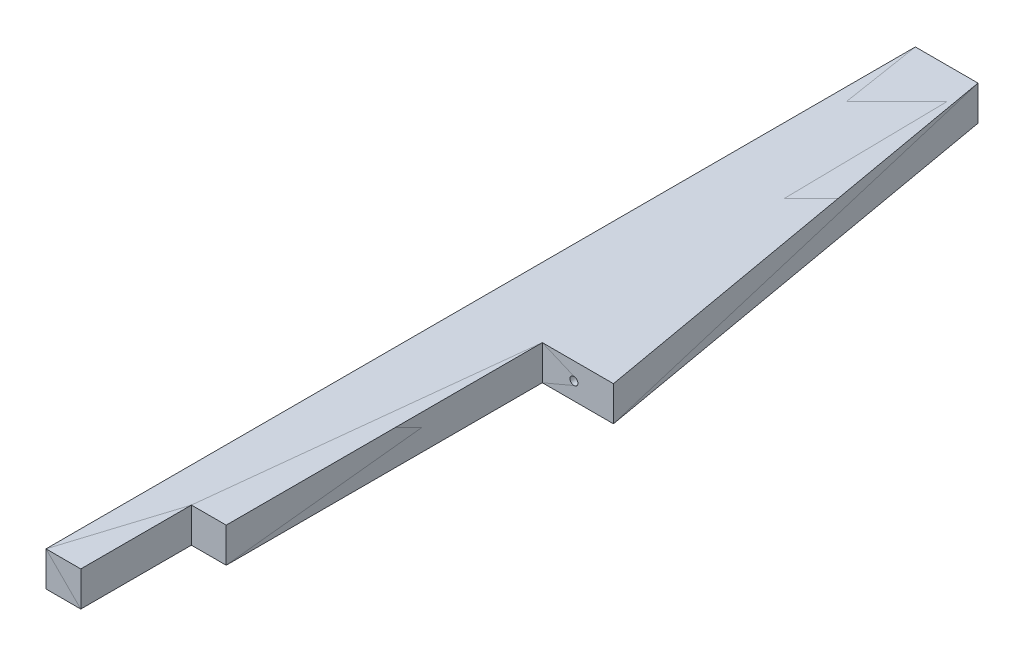
ISO-10303-21;
HEADER;
FILE_DESCRIPTION(('STEP AP214'),'2;1');
FILE_NAME('part.step','',(''),(''),'','','');
FILE_SCHEMA(('AUTOMOTIVE_DESIGN { 1 0 10303 214 1 1 1 1 }'));
ENDSEC;
DATA;
#1=APPLICATION_CONTEXT('core data for automotive mechanical design processes');
#2=APPLICATION_PROTOCOL_DEFINITION('international standard','automotive_design',2000,#1);
#3=PRODUCT_CONTEXT('',#1,'mechanical');
#4=PRODUCT('Part','Part','',(#3));
#5=PRODUCT_RELATED_PRODUCT_CATEGORY('part','',(#4));
#6=PRODUCT_DEFINITION_FORMATION('','',#4);
#7=PRODUCT_DEFINITION_CONTEXT('part definition',#1,'design');
#8=PRODUCT_DEFINITION('design','',#6,#7);
#9=PRODUCT_DEFINITION_SHAPE('','',#8);
#10=(LENGTH_UNIT() NAMED_UNIT(*) SI_UNIT(.MILLI.,.METRE.));
#11=(NAMED_UNIT(*) PLANE_ANGLE_UNIT() SI_UNIT($,.RADIAN.));
#12=(NAMED_UNIT(*) SI_UNIT($,.STERADIAN.) SOLID_ANGLE_UNIT());
#13=UNCERTAINTY_MEASURE_WITH_UNIT(LENGTH_MEASURE(1.E-05),#10,'distance_accuracy_value','');
#14=(GEOMETRIC_REPRESENTATION_CONTEXT(3) GLOBAL_UNCERTAINTY_ASSIGNED_CONTEXT((#13)) GLOBAL_UNIT_ASSIGNED_CONTEXT((#10,
#11,#12)) REPRESENTATION_CONTEXT('',''));
#15=CARTESIAN_POINT('',(0.,0.,0.));
#16=DIRECTION('',(0.,0.,1.));
#17=DIRECTION('',(1.,0.,0.));
#18=AXIS2_PLACEMENT_3D('',#15,#16,#17);
#19=CARTESIAN_POINT('',(0.,-0.01,-550.01));
#20=DIRECTION('',(-1.,0.,0.));
#21=DIRECTION('',(0.,0.,1.));
#22=AXIS2_PLACEMENT_3D('',#19,#20,#21);
#23=PLANE('',#22);
#24=DIRECTION('',(0.,0.,1.));
#25=VECTOR('',#24,1.);
#26=CARTESIAN_POINT('',(0.,22.,-275.));
#27=LINE('',#26,#25);
#28=CARTESIAN_POINT('',(0.,22.,-550.));
#29=VERTEX_POINT('',#28);
#30=CARTESIAN_POINT('',(0.,22.,0.));
#31=VERTEX_POINT('',#30);
#32=EDGE_CURVE('P0_E92',#29,#31,#27,.T.);
#33=ORIENTED_EDGE('',*,*,#32,.F.);
#34=DIRECTION('',(0.,1.,0.));
#35=VECTOR('',#34,1.);
#36=CARTESIAN_POINT('',(0.,11.,-550.));
#37=LINE('',#36,#35);
#38=CARTESIAN_POINT('',(0.,0.,-550.));
#39=VERTEX_POINT('',#38);
#40=EDGE_CURVE('P0_E89',#39,#29,#37,.T.);
#41=ORIENTED_EDGE('',*,*,#40,.F.);
#42=DIRECTION('',(0.,0.,-1.));
#43=VECTOR('',#42,1.);
#44=CARTESIAN_POINT('',(0.,0.,-275.));
#45=LINE('',#44,#43);
#46=CARTESIAN_POINT('',(0.,0.,0.));
#47=VERTEX_POINT('',#46);
#48=EDGE_CURVE('P0_E86',#47,#39,#45,.T.);
#49=ORIENTED_EDGE('',*,*,#48,.F.);
#50=DIRECTION('',(0.,-1.,0.));
#51=VECTOR('',#50,1.);
#52=CARTESIAN_POINT('',(0.,11.,0.));
#53=LINE('',#52,#51);
#54=EDGE_CURVE('P0_E115',#31,#47,#53,.T.);
#55=ORIENTED_EDGE('',*,*,#54,.F.);
#56=EDGE_LOOP('',(#33,#41,#49,#55));
#57=FACE_BOUND('',#56,.T.);
#58=ADVANCED_FACE('P0_F17',(#57),#23,.T.);
#59=CARTESIAN_POINT('',(-0.01,-0.01,0.));
#60=DIRECTION('',(0.,0.,1.));
#61=DIRECTION('',(1.,0.,0.));
#62=AXIS2_PLACEMENT_3D('',#59,#60,#61);
#63=PLANE('',#62);
#64=DIRECTION('',(1.,0.,0.));
#65=VECTOR('',#64,1.);
#66=CARTESIAN_POINT('',(44.5,22.,0.));
#67=LINE('',#66,#65);
#68=CARTESIAN_POINT('',(22.,22.,0.));
#69=VERTEX_POINT('',#68);
#70=EDGE_CURVE('P0_E153',#31,#69,#67,.T.);
#71=ORIENTED_EDGE('',*,*,#70,.F.);
#72=ORIENTED_EDGE('',*,*,#54,.T.);
#73=DIRECTION('',(-1.,0.,0.));
#74=VECTOR('',#73,1.);
#75=CARTESIAN_POINT('',(44.5,0.,0.));
#76=LINE('',#75,#74);
#77=CARTESIAN_POINT('',(22.,0.,0.));
#78=VERTEX_POINT('',#77);
#79=EDGE_CURVE('P0_E109',#78,#47,#76,.T.);
#80=ORIENTED_EDGE('',*,*,#79,.F.);
#81=DIRECTION('',(0.,-1.,0.));
#82=VECTOR('',#81,1.);
#83=CARTESIAN_POINT('',(22.,11.,0.));
#84=LINE('',#83,#82);
#85=EDGE_CURVE('P0_E97',#69,#78,#84,.T.);
#86=ORIENTED_EDGE('',*,*,#85,.F.);
#87=EDGE_LOOP('',(#71,#72,#80,#86));
#88=FACE_BOUND('',#87,.T.);
#89=ADVANCED_FACE('P0_F172',(#88),#63,.T.);
#90=CARTESIAN_POINT('',(22.,-0.01,0.01));
#91=DIRECTION('',(1.,0.,0.));
#92=DIRECTION('',(0.,0.,-1.));
#93=AXIS2_PLACEMENT_3D('',#90,#91,#92);
#94=PLANE('',#93);
#95=DIRECTION('',(0.,0.,-1.));
#96=VECTOR('',#95,1.);
#97=CARTESIAN_POINT('',(22.,22.,-275.));
#98=LINE('',#97,#96);
#99=CARTESIAN_POINT('',(22.,22.,-70.));
#100=VERTEX_POINT('',#99);
#101=EDGE_CURVE('P0_E150',#69,#100,#98,.T.);
#102=ORIENTED_EDGE('',*,*,#101,.F.);
#103=ORIENTED_EDGE('',*,*,#85,.T.);
#104=DIRECTION('',(0.,0.,1.));
#105=VECTOR('',#104,1.);
#106=CARTESIAN_POINT('',(22.,0.,-275.));
#107=LINE('',#106,#105);
#108=CARTESIAN_POINT('',(22.,0.,-70.));
#109=VERTEX_POINT('',#108);
#110=EDGE_CURVE('P0_E159',#109,#78,#107,.T.);
#111=ORIENTED_EDGE('',*,*,#110,.F.);
#112=DIRECTION('',(0.,-1.,0.));
#113=VECTOR('',#112,1.);
#114=CARTESIAN_POINT('',(22.,11.,-70.));
#115=LINE('',#114,#113);
#116=EDGE_CURVE('P0_E96',#100,#109,#115,.T.);
#117=ORIENTED_EDGE('',*,*,#116,.F.);
#118=EDGE_LOOP('',(#102,#103,#111,#117));
#119=FACE_BOUND('',#118,.T.);
#120=ADVANCED_FACE('P0_F169',(#119),#94,.T.);
#121=CARTESIAN_POINT('',(39.6384454016298,-0.01,-550.));
#122=DIRECTION('',(0.,0.,-1.));
#123=DIRECTION('',(-1.,0.,0.));
#124=AXIS2_PLACEMENT_3D('',#121,#122,#123);
#125=PLANE('',#124);
#126=DIRECTION('',(-1.,0.,0.));
#127=VECTOR('',#126,1.);
#128=CARTESIAN_POINT('',(44.5,22.,-550.));
#129=LINE('',#128,#127);
#130=CARTESIAN_POINT('',(39.6284454016298,22.,-550.));
#131=VERTEX_POINT('',#130);
#132=EDGE_CURVE('P0_E126',#131,#29,#129,.T.);
#133=ORIENTED_EDGE('',*,*,#132,.F.);
#134=DIRECTION('',(0.,1.,0.));
#135=VECTOR('',#134,1.);
#136=CARTESIAN_POINT('',(39.6284454016299,11.,-550.));
#137=LINE('',#136,#135);
#138=CARTESIAN_POINT('',(39.6284454016298,0.,-550.));
#139=VERTEX_POINT('',#138);
#140=EDGE_CURVE('P0_E102',#139,#131,#137,.T.);
#141=ORIENTED_EDGE('',*,*,#140,.F.);
#142=DIRECTION('',(1.,0.,0.));
#143=VECTOR('',#142,1.);
#144=CARTESIAN_POINT('',(44.5,0.,-550.));
#145=LINE('',#144,#143);
#146=EDGE_CURVE('P0_E100',#39,#139,#145,.T.);
#147=ORIENTED_EDGE('',*,*,#146,.F.);
#148=ORIENTED_EDGE('',*,*,#40,.T.);
#149=EDGE_LOOP('',(#133,#141,#147,#148));
#150=FACE_BOUND('',#149,.T.);
#151=ADVANCED_FACE('P0_F101',(#150),#125,.T.);
#152=CARTESIAN_POINT('',(21.99,-0.01,-70.));
#153=DIRECTION('',(0.,0.,1.));
#154=DIRECTION('',(1.,0.,0.));
#155=AXIS2_PLACEMENT_3D('',#152,#153,#154);
#156=PLANE('',#155);
#157=DIRECTION('',(1.,0.,0.));
#158=VECTOR('',#157,1.);
#159=CARTESIAN_POINT('',(44.5,22.,-70.));
#160=LINE('',#159,#158);
#161=CARTESIAN_POINT('',(44.,22.,-70.));
#162=VERTEX_POINT('',#161);
#163=EDGE_CURVE('P0_E148',#100,#162,#160,.T.);
#164=ORIENTED_EDGE('',*,*,#163,.F.);
#165=ORIENTED_EDGE('',*,*,#116,.T.);
#166=DIRECTION('',(-1.,0.,0.));
#167=VECTOR('',#166,1.);
#168=CARTESIAN_POINT('',(44.5,0.,-70.));
#169=LINE('',#168,#167);
#170=CARTESIAN_POINT('',(44.,0.,-70.));
#171=VERTEX_POINT('',#170);
#172=EDGE_CURVE('P0_E103',#171,#109,#169,.T.);
#173=ORIENTED_EDGE('',*,*,#172,.F.);
#174=DIRECTION('',(0.,-1.,0.));
#175=VECTOR('',#174,1.);
#176=CARTESIAN_POINT('',(44.,11.,-70.));
#177=LINE('',#176,#175);
#178=EDGE_CURVE('P0_E140',#162,#171,#177,.T.);
#179=ORIENTED_EDGE('',*,*,#178,.F.);
#180=EDGE_LOOP('',(#164,#165,#173,#179));
#181=FACE_BOUND('',#180,.T.);
#182=ADVANCED_FACE('P0_F166',(#181),#156,.T.);
#183=CARTESIAN_POINT('',(89.01,0.,0.0100000000000122));
#184=DIRECTION('',(0.,-1.,0.));
#185=DIRECTION('',(-1.,0.,0.));
#186=AXIS2_PLACEMENT_3D('',#183,#184,#185);
#187=PLANE('',#186);
#188=ORIENTED_EDGE('',*,*,#110,.T.);
#189=ORIENTED_EDGE('',*,*,#79,.T.);
#190=ORIENTED_EDGE('',*,*,#48,.T.);
#191=ORIENTED_EDGE('',*,*,#146,.T.);
#192=DIRECTION('',(-0.17364817766693,0.,-0.984807753012208));
#193=VECTOR('',#192,1.);
#194=CARTESIAN_POINT('',(64.314222700815,0.,-410.));
#195=LINE('',#194,#193);
#196=CARTESIAN_POINT('',(89.,0.,-270.));
#197=VERTEX_POINT('',#196);
#198=EDGE_CURVE('P0_E53',#197,#139,#195,.T.);
#199=ORIENTED_EDGE('',*,*,#198,.F.);
#200=DIRECTION('',(1.,0.,0.));
#201=VECTOR('',#200,1.);
#202=CARTESIAN_POINT('',(66.5,0.,-270.));
#203=LINE('',#202,#201);
#204=CARTESIAN_POINT('',(44.,0.,-270.));
#205=VERTEX_POINT('',#204);
#206=EDGE_CURVE('P0_E124',#205,#197,#203,.T.);
#207=ORIENTED_EDGE('',*,*,#206,.F.);
#208=DIRECTION('',(0.,0.,-1.));
#209=VECTOR('',#208,1.);
#210=CARTESIAN_POINT('',(44.,0.,-170.));
#211=LINE('',#210,#209);
#212=EDGE_CURVE('P0_E127',#171,#205,#211,.T.);
#213=ORIENTED_EDGE('',*,*,#212,.F.);
#214=ORIENTED_EDGE('',*,*,#172,.T.);
#215=EDGE_LOOP('',(#188,#189,#190,#191,#199,#207,#213,#214));
#216=FACE_BOUND('',#215,.T.);
#217=ADVANCED_FACE('P0_F107',(#216),#187,.T.);
#218=CARTESIAN_POINT('',(89.0017364817767,-0.01,-269.99015192247));
#219=DIRECTION('',(0.984807753012208,0.,-0.17364817766693));
#220=DIRECTION('',(-0.17364817766693,0.,-0.984807753012208));
#221=AXIS2_PLACEMENT_3D('',#218,#219,#220);
#222=PLANE('',#221);
#223=DIRECTION('',(-0.17364817766693,0.,-0.984807753012208));
#224=VECTOR('',#223,1.);
#225=CARTESIAN_POINT('',(89.,22.,-270.));
#226=LINE('',#225,#224);
#227=CARTESIAN_POINT('',(89.,22.,-270.));
#228=VERTEX_POINT('',#227);
#229=EDGE_CURVE('P0_E21',#228,#131,#226,.T.);
#230=ORIENTED_EDGE('',*,*,#229,.F.);
#231=DIRECTION('',(0.,1.,0.));
#232=VECTOR('',#231,1.);
#233=CARTESIAN_POINT('',(89.,11.,-270.));
#234=LINE('',#233,#232);
#235=EDGE_CURVE('P0_E121',#197,#228,#234,.T.);
#236=ORIENTED_EDGE('',*,*,#235,.F.);
#237=ORIENTED_EDGE('',*,*,#198,.T.);
#238=ORIENTED_EDGE('',*,*,#140,.T.);
#239=EDGE_LOOP('',(#230,#236,#237,#238));
#240=FACE_BOUND('',#239,.T.);
#241=ADVANCED_FACE('P0_F175',(#240),#222,.T.);
#242=CARTESIAN_POINT('',(-0.0100000000000389,22.,-550.01));
#243=DIRECTION('',(0.,1.,0.));
#244=DIRECTION('',(0.,0.,1.));
#245=AXIS2_PLACEMENT_3D('',#242,#243,#244);
#246=PLANE('',#245);
#247=ORIENTED_EDGE('',*,*,#229,.T.);
#248=ORIENTED_EDGE('',*,*,#132,.T.);
#249=ORIENTED_EDGE('',*,*,#32,.T.);
#250=ORIENTED_EDGE('',*,*,#70,.T.);
#251=ORIENTED_EDGE('',*,*,#101,.T.);
#252=ORIENTED_EDGE('',*,*,#163,.T.);
#253=DIRECTION('',(0.,0.,1.));
#254=VECTOR('',#253,1.);
#255=CARTESIAN_POINT('',(44.,22.,-170.));
#256=LINE('',#255,#254);
#257=CARTESIAN_POINT('',(44.,22.,-270.));
#258=VERTEX_POINT('',#257);
#259=EDGE_CURVE('P0_E143',#258,#162,#256,.T.);
#260=ORIENTED_EDGE('',*,*,#259,.F.);
#261=DIRECTION('',(-1.,0.,0.));
#262=VECTOR('',#261,1.);
#263=CARTESIAN_POINT('',(66.5,22.,-270.));
#264=LINE('',#263,#262);
#265=EDGE_CURVE('P0_E117',#228,#258,#264,.T.);
#266=ORIENTED_EDGE('',*,*,#265,.F.);
#267=EDGE_LOOP('',(#247,#248,#249,#250,#251,#252,#260,#266));
#268=FACE_BOUND('',#267,.T.);
#269=ADVANCED_FACE('P0_F174',(#268),#246,.T.);
#270=CARTESIAN_POINT('',(44.,-0.01,-69.99));
#271=DIRECTION('',(1.,0.,0.));
#272=DIRECTION('',(0.,0.,-1.));
#273=AXIS2_PLACEMENT_3D('',#270,#271,#272);
#274=PLANE('',#273);
#275=ORIENTED_EDGE('',*,*,#259,.T.);
#276=ORIENTED_EDGE('',*,*,#178,.T.);
#277=ORIENTED_EDGE('',*,*,#212,.T.);
#278=DIRECTION('',(0.,-1.,0.));
#279=VECTOR('',#278,1.);
#280=CARTESIAN_POINT('',(44.,11.,-270.));
#281=LINE('',#280,#279);
#282=EDGE_CURVE('P0_E120',#258,#205,#281,.T.);
#283=ORIENTED_EDGE('',*,*,#282,.F.);
#284=EDGE_LOOP('',(#275,#276,#277,#283));
#285=FACE_BOUND('',#284,.T.);
#286=ADVANCED_FACE('P0_F178',(#285),#274,.T.);
#287=CARTESIAN_POINT('',(43.99,-0.01,-270.));
#288=DIRECTION('',(0.,0.,1.));
#289=DIRECTION('',(1.,0.,0.));
#290=AXIS2_PLACEMENT_3D('',#287,#288,#289);
#291=PLANE('',#290);
#292=CARTESIAN_POINT('',(64.,11.,-270.));
#293=DIRECTION('',(0.,0.,-1.));
#294=DIRECTION('',(-1.,0.,0.));
#295=AXIS2_PLACEMENT_3D('',#292,#293,#294);
#296=CIRCLE('',#295,2.5);
#297=CARTESIAN_POINT('',(61.5,11.,-270.));
#298=VERTEX_POINT('',#297);
#299=EDGE_CURVE('P0_E27',#298,#298,#296,.F.);
#300=ORIENTED_EDGE('',*,*,#299,.F.);
#301=EDGE_LOOP('',(#300));
#302=FACE_BOUND('',#301,.T.);
#303=ORIENTED_EDGE('',*,*,#265,.T.);
#304=ORIENTED_EDGE('',*,*,#282,.T.);
#305=ORIENTED_EDGE('',*,*,#206,.T.);
#306=ORIENTED_EDGE('',*,*,#235,.T.);
#307=EDGE_LOOP('',(#303,#304,#305,#306));
#308=FACE_BOUND('',#307,.T.);
#309=ADVANCED_FACE('P0_F176',(#302,#308),#291,.T.);
#310=CARTESIAN_POINT('',(64.,11.,-270.));
#311=DIRECTION('',(0.,0.,-1.));
#312=DIRECTION('',(-1.,0.,0.));
#313=AXIS2_PLACEMENT_3D('',#310,#311,#312);
#314=CYLINDRICAL_SURFACE('',#313,2.5);
#315=CARTESIAN_POINT('',(64.,11.,-285.));
#316=DIRECTION('',(0.,0.,1.));
#317=DIRECTION('',(1.,0.,0.));
#318=AXIS2_PLACEMENT_3D('',#315,#316,#317);
#319=CIRCLE('',#318,2.5);
#320=CARTESIAN_POINT('',(66.5,11.,-285.));
#321=VERTEX_POINT('',#320);
#322=EDGE_CURVE('P0_E11',#321,#321,#319,.T.);
#323=ORIENTED_EDGE('',*,*,#322,.F.);
#324=EDGE_LOOP('',(#323));
#325=FACE_BOUND('',#324,.T.);
#326=ORIENTED_EDGE('',*,*,#299,.T.);
#327=EDGE_LOOP('',(#326));
#328=FACE_BOUND('',#327,.T.);
#329=ADVANCED_FACE('P0_F186',(#325,#328),#314,.F.);
#330=CARTESIAN_POINT('',(64.,11.,-285.));
#331=DIRECTION('',(0.,0.,1.));
#332=DIRECTION('',(1.,0.,0.));
#333=AXIS2_PLACEMENT_3D('',#330,#331,#332);
#334=CONICAL_SURFACE('',#333,2.5,1.02974425867666);
#335=ORIENTED_EDGE('',*,*,#322,.T.);
#336=EDGE_LOOP('',(#335));
#337=FACE_BOUND('',#336,.T.);
#338=CARTESIAN_POINT('',(64.,11.,-286.502151547569));
#339=VERTEX_POINT('',#338);
#340=VERTEX_LOOP('',#339);
#341=FACE_BOUND('',#340,.T.);
#342=ADVANCED_FACE('P0_F19',(#337,#341),#334,.F.);
#343=CLOSED_SHELL('',(#58,#89,#120,#151,#182,#217,#241,#269,#286,#309,#329,#342));
#344=MANIFOLD_SOLID_BREP('P0_B1',#343);
#345=CARTESIAN_POINT('',(0.,-0.01,-550.01));
#346=DIRECTION('',(-1.,0.,0.));
#347=DIRECTION('',(0.,0.,1.));
#348=AXIS2_PLACEMENT_3D('',#345,#346,#347);
#349=PLANE('',#348);
#350=DIRECTION('',(0.,0.,1.));
#351=VECTOR('',#350,1.);
#352=CARTESIAN_POINT('',(0.,22.,-275.));
#353=LINE('',#352,#351);
#354=CARTESIAN_POINT('',(0.,22.,-550.));
#355=VERTEX_POINT('',#354);
#356=CARTESIAN_POINT('',(0.,22.,0.));
#357=VERTEX_POINT('',#356);
#358=EDGE_CURVE('P1_E92',#355,#357,#353,.T.);
#359=ORIENTED_EDGE('',*,*,#358,.F.);
#360=DIRECTION('',(0.,1.,0.));
#361=VECTOR('',#360,1.);
#362=CARTESIAN_POINT('',(0.,11.,-550.));
#363=LINE('',#362,#361);
#364=CARTESIAN_POINT('',(0.,0.,-550.));
#365=VERTEX_POINT('',#364);
#366=EDGE_CURVE('P1_E89',#365,#355,#363,.T.);
#367=ORIENTED_EDGE('',*,*,#366,.F.);
#368=DIRECTION('',(0.,0.,-1.));
#369=VECTOR('',#368,1.);
#370=CARTESIAN_POINT('',(0.,0.,-275.));
#371=LINE('',#370,#369);
#372=CARTESIAN_POINT('',(0.,0.,0.));
#373=VERTEX_POINT('',#372);
#374=EDGE_CURVE('P1_E86',#373,#365,#371,.T.);
#375=ORIENTED_EDGE('',*,*,#374,.F.);
#376=DIRECTION('',(0.,-1.,0.));
#377=VECTOR('',#376,1.);
#378=CARTESIAN_POINT('',(0.,11.,0.));
#379=LINE('',#378,#377);
#380=EDGE_CURVE('P1_E115',#357,#373,#379,.T.);
#381=ORIENTED_EDGE('',*,*,#380,.F.);
#382=EDGE_LOOP('',(#359,#367,#375,#381));
#383=FACE_BOUND('',#382,.T.);
#384=ADVANCED_FACE('P1_F17',(#383),#349,.T.);
#385=CARTESIAN_POINT('',(-0.01,-0.01,0.));
#386=DIRECTION('',(0.,0.,1.));
#387=DIRECTION('',(1.,0.,0.));
#388=AXIS2_PLACEMENT_3D('',#385,#386,#387);
#389=PLANE('',#388);
#390=DIRECTION('',(1.,0.,0.));
#391=VECTOR('',#390,1.);
#392=CARTESIAN_POINT('',(44.5,22.,0.));
#393=LINE('',#392,#391);
#394=CARTESIAN_POINT('',(22.,22.,0.));
#395=VERTEX_POINT('',#394);
#396=EDGE_CURVE('P1_E153',#357,#395,#393,.T.);
#397=ORIENTED_EDGE('',*,*,#396,.F.);
#398=ORIENTED_EDGE('',*,*,#380,.T.);
#399=DIRECTION('',(-1.,0.,0.));
#400=VECTOR('',#399,1.);
#401=CARTESIAN_POINT('',(44.5,0.,0.));
#402=LINE('',#401,#400);
#403=CARTESIAN_POINT('',(22.,0.,0.));
#404=VERTEX_POINT('',#403);
#405=EDGE_CURVE('P1_E109',#404,#373,#402,.T.);
#406=ORIENTED_EDGE('',*,*,#405,.F.);
#407=DIRECTION('',(0.,-1.,0.));
#408=VECTOR('',#407,1.);
#409=CARTESIAN_POINT('',(22.,11.,0.));
#410=LINE('',#409,#408);
#411=EDGE_CURVE('P1_E97',#395,#404,#410,.T.);
#412=ORIENTED_EDGE('',*,*,#411,.F.);
#413=EDGE_LOOP('',(#397,#398,#406,#412));
#414=FACE_BOUND('',#413,.T.);
#415=ADVANCED_FACE('P1_F172',(#414),#389,.T.);
#416=CARTESIAN_POINT('',(22.,-0.01,0.01));
#417=DIRECTION('',(1.,0.,0.));
#418=DIRECTION('',(0.,0.,-1.));
#419=AXIS2_PLACEMENT_3D('',#416,#417,#418);
#420=PLANE('',#419);
#421=DIRECTION('',(0.,0.,-1.));
#422=VECTOR('',#421,1.);
#423=CARTESIAN_POINT('',(22.,22.,-275.));
#424=LINE('',#423,#422);
#425=CARTESIAN_POINT('',(22.,22.,-70.));
#426=VERTEX_POINT('',#425);
#427=EDGE_CURVE('P1_E150',#395,#426,#424,.T.);
#428=ORIENTED_EDGE('',*,*,#427,.F.);
#429=ORIENTED_EDGE('',*,*,#411,.T.);
#430=DIRECTION('',(0.,0.,1.));
#431=VECTOR('',#430,1.);
#432=CARTESIAN_POINT('',(22.,0.,-275.));
#433=LINE('',#432,#431);
#434=CARTESIAN_POINT('',(22.,0.,-70.));
#435=VERTEX_POINT('',#434);
#436=EDGE_CURVE('P1_E159',#435,#404,#433,.T.);
#437=ORIENTED_EDGE('',*,*,#436,.F.);
#438=DIRECTION('',(0.,-1.,0.));
#439=VECTOR('',#438,1.);
#440=CARTESIAN_POINT('',(22.,11.,-70.));
#441=LINE('',#440,#439);
#442=EDGE_CURVE('P1_E96',#426,#435,#441,.T.);
#443=ORIENTED_EDGE('',*,*,#442,.F.);
#444=EDGE_LOOP('',(#428,#429,#437,#443));
#445=FACE_BOUND('',#444,.T.);
#446=ADVANCED_FACE('P1_F169',(#445),#420,.T.);
#447=CARTESIAN_POINT('',(39.6384454016298,-0.01,-550.));
#448=DIRECTION('',(0.,0.,-1.));
#449=DIRECTION('',(-1.,0.,0.));
#450=AXIS2_PLACEMENT_3D('',#447,#448,#449);
#451=PLANE('',#450);
#452=DIRECTION('',(-1.,0.,0.));
#453=VECTOR('',#452,1.);
#454=CARTESIAN_POINT('',(44.5,22.,-550.));
#455=LINE('',#454,#453);
#456=CARTESIAN_POINT('',(39.6284454016298,22.,-550.));
#457=VERTEX_POINT('',#456);
#458=EDGE_CURVE('P1_E126',#457,#355,#455,.T.);
#459=ORIENTED_EDGE('',*,*,#458,.F.);
#460=DIRECTION('',(0.,1.,0.));
#461=VECTOR('',#460,1.);
#462=CARTESIAN_POINT('',(39.6284454016299,11.,-550.));
#463=LINE('',#462,#461);
#464=CARTESIAN_POINT('',(39.6284454016298,0.,-550.));
#465=VERTEX_POINT('',#464);
#466=EDGE_CURVE('P1_E102',#465,#457,#463,.T.);
#467=ORIENTED_EDGE('',*,*,#466,.F.);
#468=DIRECTION('',(1.,0.,0.));
#469=VECTOR('',#468,1.);
#470=CARTESIAN_POINT('',(44.5,0.,-550.));
#471=LINE('',#470,#469);
#472=EDGE_CURVE('P1_E100',#365,#465,#471,.T.);
#473=ORIENTED_EDGE('',*,*,#472,.F.);
#474=ORIENTED_EDGE('',*,*,#366,.T.);
#475=EDGE_LOOP('',(#459,#467,#473,#474));
#476=FACE_BOUND('',#475,.T.);
#477=ADVANCED_FACE('P1_F101',(#476),#451,.T.);
#478=CARTESIAN_POINT('',(21.99,-0.01,-70.));
#479=DIRECTION('',(0.,0.,1.));
#480=DIRECTION('',(1.,0.,0.));
#481=AXIS2_PLACEMENT_3D('',#478,#479,#480);
#482=PLANE('',#481);
#483=DIRECTION('',(1.,0.,0.));
#484=VECTOR('',#483,1.);
#485=CARTESIAN_POINT('',(44.5,22.,-70.));
#486=LINE('',#485,#484);
#487=CARTESIAN_POINT('',(44.,22.,-70.));
#488=VERTEX_POINT('',#487);
#489=EDGE_CURVE('P1_E148',#426,#488,#486,.T.);
#490=ORIENTED_EDGE('',*,*,#489,.F.);
#491=ORIENTED_EDGE('',*,*,#442,.T.);
#492=DIRECTION('',(-1.,0.,0.));
#493=VECTOR('',#492,1.);
#494=CARTESIAN_POINT('',(44.5,0.,-70.));
#495=LINE('',#494,#493);
#496=CARTESIAN_POINT('',(44.,0.,-70.));
#497=VERTEX_POINT('',#496);
#498=EDGE_CURVE('P1_E103',#497,#435,#495,.T.);
#499=ORIENTED_EDGE('',*,*,#498,.F.);
#500=DIRECTION('',(0.,-1.,0.));
#501=VECTOR('',#500,1.);
#502=CARTESIAN_POINT('',(44.,11.,-70.));
#503=LINE('',#502,#501);
#504=EDGE_CURVE('P1_E140',#488,#497,#503,.T.);
#505=ORIENTED_EDGE('',*,*,#504,.F.);
#506=EDGE_LOOP('',(#490,#491,#499,#505));
#507=FACE_BOUND('',#506,.T.);
#508=ADVANCED_FACE('P1_F166',(#507),#482,.T.);
#509=CARTESIAN_POINT('',(89.01,0.,0.0100000000000122));
#510=DIRECTION('',(0.,-1.,0.));
#511=DIRECTION('',(-1.,0.,0.));
#512=AXIS2_PLACEMENT_3D('',#509,#510,#511);
#513=PLANE('',#512);
#514=ORIENTED_EDGE('',*,*,#436,.T.);
#515=ORIENTED_EDGE('',*,*,#405,.T.);
#516=ORIENTED_EDGE('',*,*,#374,.T.);
#517=ORIENTED_EDGE('',*,*,#472,.T.);
#518=DIRECTION('',(-0.17364817766693,0.,-0.984807753012208));
#519=VECTOR('',#518,1.);
#520=CARTESIAN_POINT('',(64.314222700815,0.,-410.));
#521=LINE('',#520,#519);
#522=CARTESIAN_POINT('',(89.,0.,-270.));
#523=VERTEX_POINT('',#522);
#524=EDGE_CURVE('P1_E53',#523,#465,#521,.T.);
#525=ORIENTED_EDGE('',*,*,#524,.F.);
#526=DIRECTION('',(1.,0.,0.));
#527=VECTOR('',#526,1.);
#528=CARTESIAN_POINT('',(66.5,0.,-270.));
#529=LINE('',#528,#527);
#530=CARTESIAN_POINT('',(44.,0.,-270.));
#531=VERTEX_POINT('',#530);
#532=EDGE_CURVE('P1_E124',#531,#523,#529,.T.);
#533=ORIENTED_EDGE('',*,*,#532,.F.);
#534=DIRECTION('',(0.,0.,-1.));
#535=VECTOR('',#534,1.);
#536=CARTESIAN_POINT('',(44.,0.,-170.));
#537=LINE('',#536,#535);
#538=EDGE_CURVE('P1_E127',#497,#531,#537,.T.);
#539=ORIENTED_EDGE('',*,*,#538,.F.);
#540=ORIENTED_EDGE('',*,*,#498,.T.);
#541=EDGE_LOOP('',(#514,#515,#516,#517,#525,#533,#539,#540));
#542=FACE_BOUND('',#541,.T.);
#543=ADVANCED_FACE('P1_F107',(#542),#513,.T.);
#544=CARTESIAN_POINT('',(89.0017364817767,-0.01,-269.99015192247));
#545=DIRECTION('',(0.984807753012208,0.,-0.17364817766693));
#546=DIRECTION('',(-0.17364817766693,0.,-0.984807753012208));
#547=AXIS2_PLACEMENT_3D('',#544,#545,#546);
#548=PLANE('',#547);
#549=DIRECTION('',(-0.17364817766693,0.,-0.984807753012208));
#550=VECTOR('',#549,1.);
#551=CARTESIAN_POINT('',(89.,22.,-270.));
#552=LINE('',#551,#550);
#553=CARTESIAN_POINT('',(89.,22.,-270.));
#554=VERTEX_POINT('',#553);
#555=EDGE_CURVE('P1_E21',#554,#457,#552,.T.);
#556=ORIENTED_EDGE('',*,*,#555,.F.);
#557=DIRECTION('',(0.,1.,0.));
#558=VECTOR('',#557,1.);
#559=CARTESIAN_POINT('',(89.,11.,-270.));
#560=LINE('',#559,#558);
#561=EDGE_CURVE('P1_E121',#523,#554,#560,.T.);
#562=ORIENTED_EDGE('',*,*,#561,.F.);
#563=ORIENTED_EDGE('',*,*,#524,.T.);
#564=ORIENTED_EDGE('',*,*,#466,.T.);
#565=EDGE_LOOP('',(#556,#562,#563,#564));
#566=FACE_BOUND('',#565,.T.);
#567=ADVANCED_FACE('P1_F175',(#566),#548,.T.);
#568=CARTESIAN_POINT('',(-0.0100000000000389,22.,-550.01));
#569=DIRECTION('',(0.,1.,0.));
#570=DIRECTION('',(0.,0.,1.));
#571=AXIS2_PLACEMENT_3D('',#568,#569,#570);
#572=PLANE('',#571);
#573=ORIENTED_EDGE('',*,*,#555,.T.);
#574=ORIENTED_EDGE('',*,*,#458,.T.);
#575=ORIENTED_EDGE('',*,*,#358,.T.);
#576=ORIENTED_EDGE('',*,*,#396,.T.);
#577=ORIENTED_EDGE('',*,*,#427,.T.);
#578=ORIENTED_EDGE('',*,*,#489,.T.);
#579=DIRECTION('',(0.,0.,1.));
#580=VECTOR('',#579,1.);
#581=CARTESIAN_POINT('',(44.,22.,-170.));
#582=LINE('',#581,#580);
#583=CARTESIAN_POINT('',(44.,22.,-270.));
#584=VERTEX_POINT('',#583);
#585=EDGE_CURVE('P1_E143',#584,#488,#582,.T.);
#586=ORIENTED_EDGE('',*,*,#585,.F.);
#587=DIRECTION('',(-1.,0.,0.));
#588=VECTOR('',#587,1.);
#589=CARTESIAN_POINT('',(66.5,22.,-270.));
#590=LINE('',#589,#588);
#591=EDGE_CURVE('P1_E117',#554,#584,#590,.T.);
#592=ORIENTED_EDGE('',*,*,#591,.F.);
#593=EDGE_LOOP('',(#573,#574,#575,#576,#577,#578,#586,#592));
#594=FACE_BOUND('',#593,.T.);
#595=ADVANCED_FACE('P1_F174',(#594),#572,.T.);
#596=CARTESIAN_POINT('',(44.,-0.01,-69.99));
#597=DIRECTION('',(1.,0.,0.));
#598=DIRECTION('',(0.,0.,-1.));
#599=AXIS2_PLACEMENT_3D('',#596,#597,#598);
#600=PLANE('',#599);
#601=ORIENTED_EDGE('',*,*,#585,.T.);
#602=ORIENTED_EDGE('',*,*,#504,.T.);
#603=ORIENTED_EDGE('',*,*,#538,.T.);
#604=DIRECTION('',(0.,-1.,0.));
#605=VECTOR('',#604,1.);
#606=CARTESIAN_POINT('',(44.,11.,-270.));
#607=LINE('',#606,#605);
#608=EDGE_CURVE('P1_E120',#584,#531,#607,.T.);
#609=ORIENTED_EDGE('',*,*,#608,.F.);
#610=EDGE_LOOP('',(#601,#602,#603,#609));
#611=FACE_BOUND('',#610,.T.);
#612=ADVANCED_FACE('P1_F178',(#611),#600,.T.);
#613=CARTESIAN_POINT('',(43.99,-0.01,-270.));
#614=DIRECTION('',(0.,0.,1.));
#615=DIRECTION('',(1.,0.,0.));
#616=AXIS2_PLACEMENT_3D('',#613,#614,#615);
#617=PLANE('',#616);
#618=CARTESIAN_POINT('',(64.,11.,-270.));
#619=DIRECTION('',(0.,0.,-1.));
#620=DIRECTION('',(-1.,0.,0.));
#621=AXIS2_PLACEMENT_3D('',#618,#619,#620);
#622=CIRCLE('',#621,2.5);
#623=CARTESIAN_POINT('',(61.5,11.,-270.));
#624=VERTEX_POINT('',#623);
#625=EDGE_CURVE('P1_E27',#624,#624,#622,.F.);
#626=ORIENTED_EDGE('',*,*,#625,.F.);
#627=EDGE_LOOP('',(#626));
#628=FACE_BOUND('',#627,.T.);
#629=ORIENTED_EDGE('',*,*,#591,.T.);
#630=ORIENTED_EDGE('',*,*,#608,.T.);
#631=ORIENTED_EDGE('',*,*,#532,.T.);
#632=ORIENTED_EDGE('',*,*,#561,.T.);
#633=EDGE_LOOP('',(#629,#630,#631,#632));
#634=FACE_BOUND('',#633,.T.);
#635=ADVANCED_FACE('P1_F176',(#628,#634),#617,.T.);
#636=CARTESIAN_POINT('',(64.,11.,-270.));
#637=DIRECTION('',(0.,0.,-1.));
#638=DIRECTION('',(-1.,0.,0.));
#639=AXIS2_PLACEMENT_3D('',#636,#637,#638);
#640=CYLINDRICAL_SURFACE('',#639,2.5);
#641=CARTESIAN_POINT('',(64.,11.,-285.));
#642=DIRECTION('',(0.,0.,1.));
#643=DIRECTION('',(1.,0.,0.));
#644=AXIS2_PLACEMENT_3D('',#641,#642,#643);
#645=CIRCLE('',#644,2.5);
#646=CARTESIAN_POINT('',(66.5,11.,-285.));
#647=VERTEX_POINT('',#646);
#648=EDGE_CURVE('P1_E11',#647,#647,#645,.T.);
#649=ORIENTED_EDGE('',*,*,#648,.F.);
#650=EDGE_LOOP('',(#649));
#651=FACE_BOUND('',#650,.T.);
#652=ORIENTED_EDGE('',*,*,#625,.T.);
#653=EDGE_LOOP('',(#652));
#654=FACE_BOUND('',#653,.T.);
#655=ADVANCED_FACE('P1_F186',(#651,#654),#640,.F.);
#656=CARTESIAN_POINT('',(64.,11.,-285.));
#657=DIRECTION('',(0.,0.,1.));
#658=DIRECTION('',(1.,0.,0.));
#659=AXIS2_PLACEMENT_3D('',#656,#657,#658);
#660=CONICAL_SURFACE('',#659,2.5,1.02974425867666);
#661=ORIENTED_EDGE('',*,*,#648,.T.);
#662=EDGE_LOOP('',(#661));
#663=FACE_BOUND('',#662,.T.);
#664=CARTESIAN_POINT('',(64.,11.,-286.502151547569));
#665=VERTEX_POINT('',#664);
#666=VERTEX_LOOP('',#665);
#667=FACE_BOUND('',#666,.T.);
#668=ADVANCED_FACE('P1_F19',(#663,#667),#660,.F.);
#669=CLOSED_SHELL('',(#384,#415,#446,#477,#508,#543,#567,#595,#612,#635,#655,#668));
#670=MANIFOLD_SOLID_BREP('P1_B1',#669);
#671=ADVANCED_BREP_SHAPE_REPRESENTATION('',(#18,#344,#670),#14);
#672=SHAPE_DEFINITION_REPRESENTATION(#9,#671);
ENDSEC;
END-ISO-10303-21;
